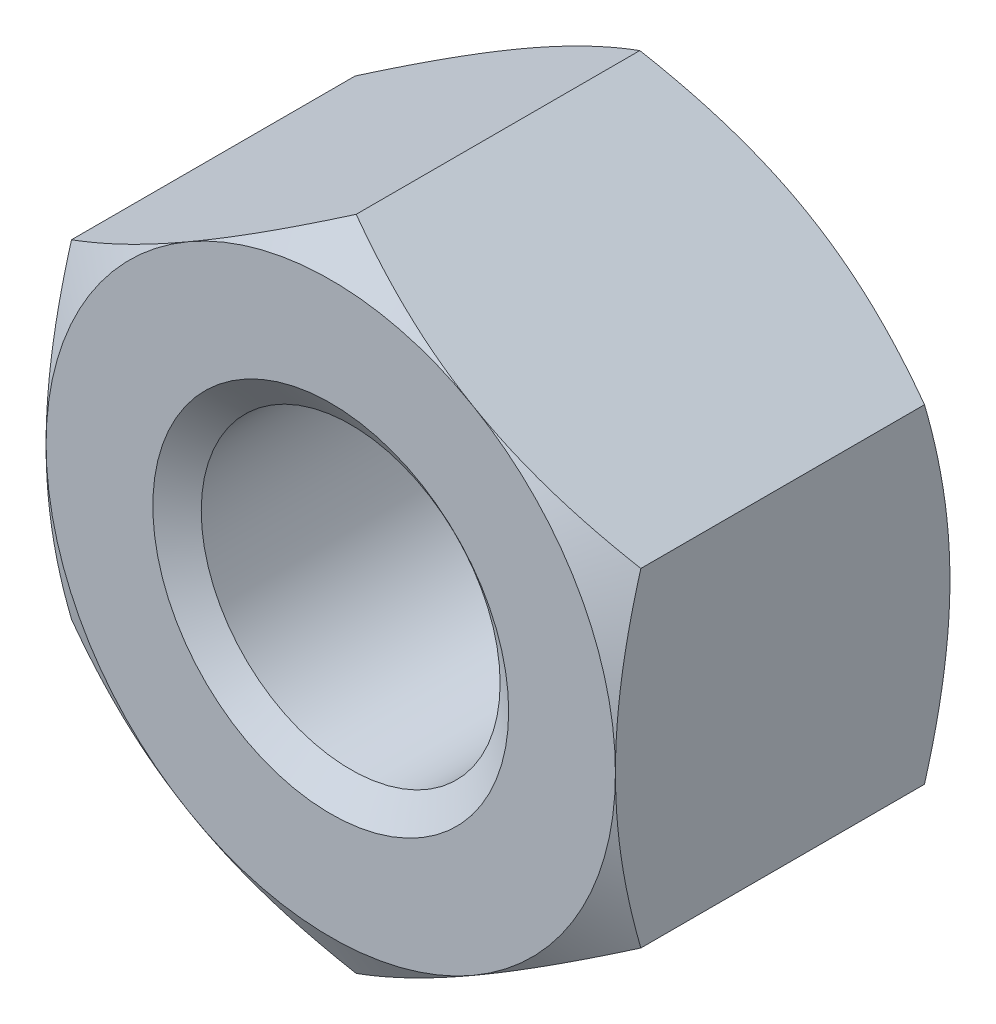
ISO-10303-21;
HEADER;
FILE_DESCRIPTION(('STEP AP214'),'2;1');
FILE_NAME('part.step','',(''),(''),'','','');
FILE_SCHEMA(('AUTOMOTIVE_DESIGN { 1 0 10303 214 1 1 1 1 }'));
ENDSEC;
DATA;
#1=APPLICATION_CONTEXT('core data for automotive mechanical design processes');
#2=APPLICATION_PROTOCOL_DEFINITION('international standard','automotive_design',2000,#1);
#3=PRODUCT_CONTEXT('',#1,'mechanical');
#4=PRODUCT('Part','Part','',(#3));
#5=PRODUCT_RELATED_PRODUCT_CATEGORY('part','',(#4));
#6=PRODUCT_DEFINITION_FORMATION('','',#4);
#7=PRODUCT_DEFINITION_CONTEXT('part definition',#1,'design');
#8=PRODUCT_DEFINITION('design','',#6,#7);
#9=PRODUCT_DEFINITION_SHAPE('','',#8);
#10=(LENGTH_UNIT() NAMED_UNIT(*) SI_UNIT(.MILLI.,.METRE.));
#11=(NAMED_UNIT(*) PLANE_ANGLE_UNIT() SI_UNIT($,.RADIAN.));
#12=(NAMED_UNIT(*) SI_UNIT($,.STERADIAN.) SOLID_ANGLE_UNIT());
#13=UNCERTAINTY_MEASURE_WITH_UNIT(LENGTH_MEASURE(1.E-05),#10,'distance_accuracy_value','');
#14=(GEOMETRIC_REPRESENTATION_CONTEXT(3) GLOBAL_UNCERTAINTY_ASSIGNED_CONTEXT((#13)) GLOBAL_UNIT_ASSIGNED_CONTEXT((#10,
#11,#12)) REPRESENTATION_CONTEXT('',''));
#15=CARTESIAN_POINT('',(0.,0.,0.));
#16=DIRECTION('',(0.,0.,1.));
#17=DIRECTION('',(1.,0.,0.));
#18=AXIS2_PLACEMENT_3D('',#15,#16,#17);
#19=CARTESIAN_POINT('',(0.,0.,-4.7));
#20=DIRECTION('',(0.,0.,1.));
#21=DIRECTION('',(1.,0.,0.));
#22=AXIS2_PLACEMENT_3D('',#19,#20,#21);
#23=CYLINDRICAL_SURFACE('',#22,2.1);
#24=CARTESIAN_POINT('',(0.,0.,-0.280083015283886));
#25=DIRECTION('',(0.,0.,1.));
#26=DIRECTION('',(1.,0.,0.));
#27=AXIS2_PLACEMENT_3D('',#24,#25,#26);
#28=CIRCLE('',#27,2.1);
#29=CARTESIAN_POINT('',(2.1,0.,-0.280083015283886));
#30=VERTEX_POINT('',#29);
#31=EDGE_CURVE('E176',#30,#30,#28,.F.);
#32=ORIENTED_EDGE('',*,*,#31,.F.);
#33=EDGE_LOOP('',(#32));
#34=FACE_BOUND('',#33,.T.);
#35=CARTESIAN_POINT('',(0.,0.,-4.39451698471612));
#36=DIRECTION('',(0.,0.,-1.));
#37=DIRECTION('',(-1.,0.,0.));
#38=AXIS2_PLACEMENT_3D('',#35,#36,#37);
#39=CIRCLE('',#38,2.1);
#40=CARTESIAN_POINT('',(-2.1,0.,-4.39451698471612));
#41=VERTEX_POINT('',#40);
#42=EDGE_CURVE('E40',#41,#41,#39,.F.);
#43=ORIENTED_EDGE('',*,*,#42,.F.);
#44=EDGE_LOOP('',(#43));
#45=FACE_BOUND('',#44,.T.);
#46=ADVANCED_FACE('F35',(#34,#45),#23,.F.);
#47=CARTESIAN_POINT('',(0.,4.61880215351701,-4.7));
#48=DIRECTION('',(-0.500000000000001,0.866025403784438,0.));
#49=DIRECTION('',(-0.866025403784438,-0.500000000000001,0.));
#50=AXIS2_PLACEMENT_3D('',#47,#48,#49);
#51=PLANE('',#50);
#52=DIRECTION('',(0.,0.,1.));
#53=VECTOR('',#52,1.);
#54=CARTESIAN_POINT('',(-4.,2.3094010767585,-4.7));
#55=LINE('',#54,#53);
#56=CARTESIAN_POINT('',(-4.,2.30940107675851,-4.34273441009183));
#57=VERTEX_POINT('',#56);
#58=CARTESIAN_POINT('',(-4.,2.3094010767585,-0.357265589908164));
#59=VERTEX_POINT('',#58);
#60=EDGE_CURVE('E166',#57,#59,#55,.T.);
#61=ORIENTED_EDGE('',*,*,#60,.T.);
#62=CARTESIAN_POINT('',(-4.0002,2.30928560670466,-0.357332259074768));
#63=CARTESIAN_POINT('',(-3.82442084967677,2.4107717464617,-0.298717873648283));
#64=CARTESIAN_POINT('',(-3.64712438367362,2.51313390883499,-0.245410321462263));
#65=CARTESIAN_POINT('',(-3.28946140682429,2.71963072479811,-0.152361670746403));
#66=CARTESIAN_POINT('',(-3.10908854102985,2.82376904741904,-0.112653489029704));
#67=CARTESIAN_POINT('',(-2.75057818129721,3.03075510011795,-0.0508422152802785));
#68=CARTESIAN_POINT('',(-2.57249584706486,3.13357098372492,-0.028327731522888));
#69=CARTESIAN_POINT('',(-2.21549328283349,3.33968651028528,-0.00145062314658079));
#70=CARTESIAN_POINT('',(-2.0365743503559,3.44298540411434,0.00293425857305778));
#71=CARTESIAN_POINT('',(-1.70225715780327,3.63600352522932,-0.00619007293996942));
#72=CARTESIAN_POINT('',(-1.54680884001293,3.72575165335065,-0.0174589539879935));
#73=CARTESIAN_POINT('',(-1.23692494436494,3.90466320392054,-0.0531739907981929));
#74=CARTESIAN_POINT('',(-1.08249043825587,3.99382600759478,-0.0776323457115331));
#75=CARTESIAN_POINT('',(-0.771967672225421,4.17310641015197,-0.13877606491929));
#76=CARTESIAN_POINT('',(-0.615918711936897,4.26320131938131,-0.175720603654865));
#77=CARTESIAN_POINT('',(-0.30614816459616,4.44204742827551,-0.259570072548029));
#78=CARTESIAN_POINT('',(-0.15242260922622,4.53080091904966,-0.306455302212742));
#79=CARTESIAN_POINT('',(0.000200000000000039,4.61891762357085,-0.35733225907477));
#80=B_SPLINE_CURVE_WITH_KNOTS('',3,(#62,#63,#64,#65,#66,#67,#68,#69,#70,#71,#72,#73,#74,#75,#76,
#77,#78,#79),.UNSPECIFIED.,.F.,.F.,(4,2,2,2,2,2,2,2,4),(0.,0.634047835695967,1.26961969224544,
1.88946157213122,2.50854226669297,3.04757825393386,3.58711366126904,4.13861653143764,
4.68903648037743),.UNSPECIFIED.);
#81=CARTESIAN_POINT('',(-2.,3.46410161513775,0.));
#82=VERTEX_POINT('',#81);
#83=EDGE_CURVE('E62',#59,#82,#80,.T.);
#84=ORIENTED_EDGE('',*,*,#83,.T.);
#85=CARTESIAN_POINT('',(0.,4.61880215351701,-0.357265589908166));
#86=VERTEX_POINT('',#85);
#87=EDGE_CURVE('E245',#82,#86,#80,.T.);
#88=ORIENTED_EDGE('',*,*,#87,.T.);
#89=DIRECTION('',(0.,0.,1.));
#90=VECTOR('',#89,1.);
#91=CARTESIAN_POINT('',(0.,4.61880215351701,-4.7));
#92=LINE('',#91,#90);
#93=CARTESIAN_POINT('',(0.,4.61880215351701,-4.34273441009183));
#94=VERTEX_POINT('',#93);
#95=EDGE_CURVE('E151',#94,#86,#92,.T.);
#96=ORIENTED_EDGE('',*,*,#95,.F.);
#97=CARTESIAN_POINT('',(-4.0002,2.30928560670466,-4.34266774092523));
#98=CARTESIAN_POINT('',(-3.82442084967677,2.4107717464617,-4.40128212635172));
#99=CARTESIAN_POINT('',(-3.64712438367362,2.51313390883499,-4.45458967853774));
#100=CARTESIAN_POINT('',(-3.28946140682429,2.71963072479811,-4.5476383292536));
#101=CARTESIAN_POINT('',(-3.10908854102985,2.82376904741904,-4.5873465109703));
#102=CARTESIAN_POINT('',(-2.75057818129721,3.03075510011795,-4.64915778471972));
#103=CARTESIAN_POINT('',(-2.57249584706486,3.13357098372492,-4.67167226847711));
#104=CARTESIAN_POINT('',(-2.21549328283349,3.33968651028528,-4.69854937685342));
#105=CARTESIAN_POINT('',(-2.0365743503559,3.44298540411434,-4.70293425857306));
#106=CARTESIAN_POINT('',(-1.70225715780327,3.63600352522932,-4.69380992706003));
#107=CARTESIAN_POINT('',(-1.54680884001293,3.72575165335065,-4.68254104601201));
#108=CARTESIAN_POINT('',(-1.23692494436494,3.90466320392054,-4.64682600920181));
#109=CARTESIAN_POINT('',(-1.08249043825587,3.99382600759479,-4.62236765428847));
#110=CARTESIAN_POINT('',(-0.771967672225421,4.17310641015197,-4.56122393508071));
#111=CARTESIAN_POINT('',(-0.615918711936897,4.26320131938131,-4.52427939634514));
#112=CARTESIAN_POINT('',(-0.30614816459616,4.44204742827551,-4.44042992745197));
#113=CARTESIAN_POINT('',(-0.152422609226221,4.53080091904966,-4.39354469778726));
#114=CARTESIAN_POINT('',(0.000200000000000049,4.61891762357085,-4.34266774092523));
#115=B_SPLINE_CURVE_WITH_KNOTS('',3,(#97,#98,#99,#100,#101,#102,#103,#104,#105,#106,#107,#108,
#109,#110,#111,#112,#113,#114),.UNSPECIFIED.,.F.,.F.,(4,2,2,2,2,2,2,2,4),(0.,0.634047835695967,
1.26961969224544,1.88946157213122,2.50854226669297,3.04757825393386,3.58711366126904,
4.13861653143764,4.68903648037743),.UNSPECIFIED.);
#116=CARTESIAN_POINT('',(-2.,3.46410161513775,-4.7));
#117=VERTEX_POINT('',#116);
#118=EDGE_CURVE('E169',#117,#94,#115,.T.);
#119=ORIENTED_EDGE('',*,*,#118,.F.);
#120=EDGE_CURVE('E268',#57,#117,#115,.T.);
#121=ORIENTED_EDGE('',*,*,#120,.F.);
#122=EDGE_LOOP('',(#61,#84,#88,#96,#119,#121));
#123=FACE_BOUND('',#122,.T.);
#124=ADVANCED_FACE('F37',(#123),#51,.T.);
#125=CARTESIAN_POINT('',(4.,2.3094010767585,-4.7));
#126=DIRECTION('',(0.500000000000001,0.866025403784438,0.));
#127=DIRECTION('',(-0.866025403784438,0.500000000000001,0.));
#128=AXIS2_PLACEMENT_3D('',#125,#126,#127);
#129=PLANE('',#128);
#130=ORIENTED_EDGE('',*,*,#95,.T.);
#131=CARTESIAN_POINT('',(-0.000199999999999629,4.61891762357085,-0.35733225907477));
#132=CARTESIAN_POINT('',(0.175579150323229,4.51743148381381,-0.298717873648285));
#133=CARTESIAN_POINT('',(0.352875616326382,4.41506932144052,-0.245410321462265));
#134=CARTESIAN_POINT('',(0.710538593175707,4.2085725054774,-0.152361670746404));
#135=CARTESIAN_POINT('',(0.890911458970152,4.10443418285647,-0.112653489029704));
#136=CARTESIAN_POINT('',(1.24942181870279,3.89744813015756,-0.0508422152802785));
#137=CARTESIAN_POINT('',(1.42750415293514,3.79463224655059,-0.0283277315228882));
#138=CARTESIAN_POINT('',(1.78450671716651,3.58851671999023,-0.00145062314658112));
#139=CARTESIAN_POINT('',(1.9634256496441,3.48521782616117,0.00293425857305746));
#140=CARTESIAN_POINT('',(2.29774284219673,3.29219970504619,-0.00619007293996938));
#141=CARTESIAN_POINT('',(2.45319115998707,3.20245157692486,-0.0174589539879932));
#142=CARTESIAN_POINT('',(2.76307505563506,3.02354002635496,-0.0531739907981921));
#143=CARTESIAN_POINT('',(2.91750956174413,2.93437722268072,-0.0776323457115322));
#144=CARTESIAN_POINT('',(3.22803232777458,2.75509682012354,-0.138776064919289));
#145=CARTESIAN_POINT('',(3.3840812880631,2.6650019108942,-0.175720603654864));
#146=CARTESIAN_POINT('',(3.69385183540384,2.486155802,-0.259570072548028));
#147=CARTESIAN_POINT('',(3.84757739077378,2.39740231122584,-0.306455302212741));
#148=CARTESIAN_POINT('',(4.0002,2.30928560670466,-0.357332259074768));
#149=B_SPLINE_CURVE_WITH_KNOTS('',3,(#131,#132,#133,#134,#135,#136,#137,#138,#139,#140,#141,
#142,#143,#144,#145,#146,#147,#148),.UNSPECIFIED.,.F.,.F.,(4,2,2,2,2,2,2,2,4),(0.,
0.634047835695967,1.26961969224544,1.88946157213122,2.50854226669297,3.04757825393386,
3.58711366126904,4.13861653143764,4.68903648037743),.UNSPECIFIED.);
#150=CARTESIAN_POINT('',(2.,3.46410161513775,0.));
#151=VERTEX_POINT('',#150);
#152=EDGE_CURVE('E144',#86,#151,#149,.T.);
#153=ORIENTED_EDGE('',*,*,#152,.T.);
#154=CARTESIAN_POINT('',(4.,2.30940107675851,-0.357265589908166));
#155=VERTEX_POINT('',#154);
#156=EDGE_CURVE('E130',#151,#155,#149,.T.);
#157=ORIENTED_EDGE('',*,*,#156,.T.);
#158=DIRECTION('',(0.,0.,1.));
#159=VECTOR('',#158,1.);
#160=CARTESIAN_POINT('',(4.,2.3094010767585,-4.7));
#161=LINE('',#160,#159);
#162=CARTESIAN_POINT('',(4.,2.30940107675851,-4.34273441009183));
#163=VERTEX_POINT('',#162);
#164=EDGE_CURVE('E143',#163,#155,#161,.T.);
#165=ORIENTED_EDGE('',*,*,#164,.F.);
#166=CARTESIAN_POINT('',(-0.000199999999999838,4.61891762357085,-4.34266774092523));
#167=CARTESIAN_POINT('',(0.175579150323229,4.51743148381381,-4.40128212635172));
#168=CARTESIAN_POINT('',(0.352875616326382,4.41506932144052,-4.45458967853773));
#169=CARTESIAN_POINT('',(0.710538593175708,4.20857250547739,-4.5476383292536));
#170=CARTESIAN_POINT('',(0.890911458970152,4.10443418285647,-4.5873465109703));
#171=CARTESIAN_POINT('',(1.24942181870279,3.89744813015756,-4.64915778471972));
#172=CARTESIAN_POINT('',(1.42750415293514,3.79463224655059,-4.67167226847711));
#173=CARTESIAN_POINT('',(1.78450671716651,3.58851671999023,-4.69854937685342));
#174=CARTESIAN_POINT('',(1.9634256496441,3.48521782616117,-4.70293425857306));
#175=CARTESIAN_POINT('',(2.29774284219673,3.29219970504619,-4.69380992706003));
#176=CARTESIAN_POINT('',(2.45319115998707,3.20245157692486,-4.68254104601201));
#177=CARTESIAN_POINT('',(2.76307505563506,3.02354002635496,-4.64682600920181));
#178=CARTESIAN_POINT('',(2.91750956174413,2.93437722268072,-4.62236765428847));
#179=CARTESIAN_POINT('',(3.22803232777458,2.75509682012354,-4.56122393508071));
#180=CARTESIAN_POINT('',(3.3840812880631,2.6650019108942,-4.52427939634514));
#181=CARTESIAN_POINT('',(3.69385183540384,2.486155802,-4.44042992745197));
#182=CARTESIAN_POINT('',(3.84757739077378,2.39740231122584,-4.39354469778726));
#183=CARTESIAN_POINT('',(4.0002,2.30928560670466,-4.34266774092523));
#184=B_SPLINE_CURVE_WITH_KNOTS('',3,(#166,#167,#168,#169,#170,#171,#172,#173,#174,#175,#176,
#177,#178,#179,#180,#181,#182,#183),.UNSPECIFIED.,.F.,.F.,(4,2,2,2,2,2,2,2,4),(0.,
0.634047835695967,1.26961969224544,1.88946157213122,2.50854226669297,3.04757825393386,
3.58711366126904,4.13861653143764,4.68903648037743),.UNSPECIFIED.);
#185=CARTESIAN_POINT('',(2.,3.46410161513775,-4.7));
#186=VERTEX_POINT('',#185);
#187=EDGE_CURVE('E261',#186,#163,#184,.T.);
#188=ORIENTED_EDGE('',*,*,#187,.F.);
#189=EDGE_CURVE('E267',#94,#186,#184,.T.);
#190=ORIENTED_EDGE('',*,*,#189,.F.);
#191=EDGE_LOOP('',(#130,#153,#157,#165,#188,#190));
#192=FACE_BOUND('',#191,.T.);
#193=ADVANCED_FACE('F141',(#192),#129,.T.);
#194=CARTESIAN_POINT('',(4.,2.3094010767585,-4.7));
#195=DIRECTION('',(-1.,0.,0.));
#196=DIRECTION('',(0.,0.,1.));
#197=AXIS2_PLACEMENT_3D('',#194,#195,#196);
#198=PLANE('',#197);
#199=CARTESIAN_POINT('',(4.,-6.12487198995892,-1.91410682124064));
#200=CARTESIAN_POINT('',(4.,-5.94924937038676,-1.8292362707669));
#201=CARTESIAN_POINT('',(4.,-5.77321152095286,-1.7452094038074));
#202=CARTESIAN_POINT('',(4.,-5.42008084777954,-1.57932514679717));
#203=CARTESIAN_POINT('',(4.,-5.24298784779927,-1.49746813236723));
#204=CARTESIAN_POINT('',(4.,-4.88656571686334,-1.33597446305856));
#205=CARTESIAN_POINT('',(4.,-4.70722958889362,-1.25635319506304));
#206=CARTESIAN_POINT('',(4.,-4.34708334747263,-1.1005305854203));
#207=CARTESIAN_POINT('',(4.,-4.16627331143537,-1.02432906550802));
#208=CARTESIAN_POINT('',(4.,-3.80064706744977,-0.875350650394363));
#209=CARTESIAN_POINT('',(4.,-3.6158089282277,-0.802627284215846));
#210=CARTESIAN_POINT('',(4.,-3.24395246794968,-0.66287623095942));
#211=CARTESIAN_POINT('',(4.,-3.05693390695801,-0.595849177566505));
#212=CARTESIAN_POINT('',(4.,-2.6808031825377,-0.469291748430882));
#213=CARTESIAN_POINT('',(4.,-2.49169643712848,-0.409745434783838));
#214=CARTESIAN_POINT('',(4.,-2.11079454635851,-0.300083356544506));
#215=CARTESIAN_POINT('',(4.,-1.91900027185749,-0.249964609676752));
#216=CARTESIAN_POINT('',(4.,-1.532592326982,-0.161590794954041));
#217=CARTESIAN_POINT('',(4.,-1.3379779203165,-0.12333888595654));
#218=CARTESIAN_POINT('',(4.,-0.946402725872553,-0.0612742359223427));
#219=CARTESIAN_POINT('',(4.,-0.749441936019773,-0.0374615076516983));
#220=CARTESIAN_POINT('',(4.,-0.355451989627942,-0.00638181314943576));
#221=CARTESIAN_POINT('',(4.,-0.15843131109401,0.000989900761041864));
#222=CARTESIAN_POINT('',(4.,0.23547208560747,-0.00120406637479539));
#223=CARTESIAN_POINT('',(4.,0.432354826312206,-0.0107653508153508));
#224=CARTESIAN_POINT('',(4.,0.768560635225518,-0.040878734613591));
#225=CARTESIAN_POINT('',(4.,0.90825461838182,-0.05750929604391));
#226=CARTESIAN_POINT('',(4.,1.18656349063497,-0.098213410346692));
#227=CARTESIAN_POINT('',(4.,1.32517820601013,-0.122288137058446));
#228=CARTESIAN_POINT('',(4.,1.73929045452969,-0.204415070950231));
#229=CARTESIAN_POINT('',(4.,2.01284690528722,-0.272348886425154));
#230=CARTESIAN_POINT('',(4.,2.42218253014524,-0.389516359317205));
#231=CARTESIAN_POINT('',(4.,2.56009536361539,-0.431713941811638));
#232=CARTESIAN_POINT('',(4.,2.83448159101404,-0.520284580227764));
#233=CARTESIAN_POINT('',(4.,2.97095590623557,-0.566654756186914));
#234=CARTESIAN_POINT('',(4.,3.24189440516341,-0.662605699180288));
#235=CARTESIAN_POINT('',(4.,3.37636557946838,-0.712166925753502));
#236=CARTESIAN_POINT('',(4.,3.64426461152914,-0.814198353790704));
#237=CARTESIAN_POINT('',(4.,3.77769202239387,-0.866669730963371));
#238=CARTESIAN_POINT('',(4.,3.91063698986684,-0.920309006541794));
#239=B_SPLINE_CURVE_WITH_KNOTS('',3,(#199,#200,#201,#202,#203,#204,#205,#206,#207,#208,#209,
#210,#211,#212,#213,#214,#215,#216,#217,#218,#219,#220,#221,#222,#223,#224,#225,#226,#227,#228,
#229,#230,#231,#232,#233,#234,#235,#236,#237,#238),.UNSPECIFIED.,.F.,.F.,(4,2,2,2,2,2,2,2,2,2,2,
2,2,2,2,2,2,2,2,4),(0.,0.585171792532271,1.17044423059927,1.7590659464599,2.34765694284827,
2.94347400997483,3.53935727210689,4.13394864697601,4.72835161391471,5.32291267067845,
5.91747425310813,6.50823685854037,7.09884609659886,7.52068140825521,7.9425832713084,
8.7870149135983,9.21965281897689,9.65199437116297,10.0819024146297,10.5119854255247),.UNSPECIFIED.);
#240=CARTESIAN_POINT('',(4.,-2.30940107675851,-0.357265589908166));
#241=VERTEX_POINT('',#240);
#242=CARTESIAN_POINT('',(4.,0.,0.));
#243=VERTEX_POINT('',#242);
#244=EDGE_CURVE('E136',#241,#243,#239,.T.);
#245=ORIENTED_EDGE('',*,*,#244,.F.);
#246=DIRECTION('',(0.,0.,1.));
#247=VECTOR('',#246,1.);
#248=CARTESIAN_POINT('',(4.,-2.30940107675851,-4.7));
#249=LINE('',#248,#247);
#250=CARTESIAN_POINT('',(4.,-2.30940107675851,-4.34273441009183));
#251=VERTEX_POINT('',#250);
#252=EDGE_CURVE('E152',#251,#241,#249,.T.);
#253=ORIENTED_EDGE('',*,*,#252,.F.);
#254=CARTESIAN_POINT('',(4.,-6.12487198995892,-2.78589317875936));
#255=CARTESIAN_POINT('',(4.,-5.94924937038676,-2.8707637292331));
#256=CARTESIAN_POINT('',(4.,-5.77321152095286,-2.9547905961926));
#257=CARTESIAN_POINT('',(4.,-5.42008084777954,-3.12067485320283));
#258=CARTESIAN_POINT('',(4.,-5.24298784779928,-3.20253186763277));
#259=CARTESIAN_POINT('',(4.,-4.88656571686334,-3.36402553694144));
#260=CARTESIAN_POINT('',(4.,-4.70722958889362,-3.44364680493696));
#261=CARTESIAN_POINT('',(4.,-4.34708334747263,-3.5994694145797));
#262=CARTESIAN_POINT('',(4.,-4.16627331143537,-3.67567093449198));
#263=CARTESIAN_POINT('',(4.,-3.80064706744978,-3.82464934960564));
#264=CARTESIAN_POINT('',(4.,-3.6158089282277,-3.89737271578415));
#265=CARTESIAN_POINT('',(4.,-3.24395246794968,-4.03712376904058));
#266=CARTESIAN_POINT('',(4.,-3.05693390695801,-4.1041508224335));
#267=CARTESIAN_POINT('',(4.,-2.68080318253771,-4.23070825156912));
#268=CARTESIAN_POINT('',(4.,-2.49169643712849,-4.29025456521616));
#269=CARTESIAN_POINT('',(4.,-2.11079454635851,-4.39991664345549));
#270=CARTESIAN_POINT('',(4.,-1.91900027185749,-4.45003539032325));
#271=CARTESIAN_POINT('',(4.,-1.532592326982,-4.53840920504596));
#272=CARTESIAN_POINT('',(4.,-1.3379779203165,-4.57666111404346));
#273=CARTESIAN_POINT('',(4.,-0.946402725872553,-4.63872576407766));
#274=CARTESIAN_POINT('',(4.,-0.749441936019773,-4.6625384923483));
#275=CARTESIAN_POINT('',(4.,-0.355451989627942,-4.69361818685056));
#276=CARTESIAN_POINT('',(4.,-0.158431311094011,-4.70098990076104));
#277=CARTESIAN_POINT('',(4.,0.235472085607469,-4.69879593362521));
#278=CARTESIAN_POINT('',(4.,0.432354826312206,-4.68923464918465));
#279=CARTESIAN_POINT('',(4.,0.768560635225517,-4.65912126538641));
#280=CARTESIAN_POINT('',(4.,0.90825461838182,-4.64249070395609));
#281=CARTESIAN_POINT('',(4.,1.18656349063497,-4.60178658965331));
#282=CARTESIAN_POINT('',(4.,1.32517820601013,-4.57771186294155));
#283=CARTESIAN_POINT('',(4.,1.73929045452969,-4.49558492904977));
#284=CARTESIAN_POINT('',(4.,2.01284690528722,-4.42765111357485));
#285=CARTESIAN_POINT('',(4.,2.42218253014524,-4.3104836406828));
#286=CARTESIAN_POINT('',(4.,2.56009536361538,-4.26828605818836));
#287=CARTESIAN_POINT('',(4.,2.83448159101404,-4.17971541977224));
#288=CARTESIAN_POINT('',(4.,2.97095590623557,-4.13334524381309));
#289=CARTESIAN_POINT('',(4.,3.24189440516341,-4.03739430081971));
#290=CARTESIAN_POINT('',(4.,3.37636557946838,-3.9878330742465));
#291=CARTESIAN_POINT('',(4.,3.64426461152914,-3.8858016462093));
#292=CARTESIAN_POINT('',(4.,3.77769202239387,-3.83333026903663));
#293=CARTESIAN_POINT('',(4.,3.91063698986684,-3.77969099345821));
#294=B_SPLINE_CURVE_WITH_KNOTS('',3,(#254,#255,#256,#257,#258,#259,#260,#261,#262,#263,#264,
#265,#266,#267,#268,#269,#270,#271,#272,#273,#274,#275,#276,#277,#278,#279,#280,#281,#282,#283,
#284,#285,#286,#287,#288,#289,#290,#291,#292,#293),.UNSPECIFIED.,.F.,.F.,(4,2,2,2,2,2,2,2,2,2,2,
2,2,2,2,2,2,2,2,4),(0.,0.585171792532271,1.17044423059927,1.7590659464599,2.34765694284827,
2.94347400997483,3.53935727210689,4.133948646976,4.72835161391471,5.32291267067845,
5.91747425310813,6.50823685854037,7.09884609659886,7.52068140825521,7.9425832713084,
8.78701491359829,9.21965281897689,9.65199437116297,10.0819024146297,10.5119854255247),.UNSPECIFIED.);
#295=CARTESIAN_POINT('',(4.,0.,-4.7));
#296=VERTEX_POINT('',#295);
#297=EDGE_CURVE('E274',#251,#296,#294,.T.);
#298=ORIENTED_EDGE('',*,*,#297,.T.);
#299=EDGE_CURVE('E150',#296,#163,#294,.T.);
#300=ORIENTED_EDGE('',*,*,#299,.T.);
#301=ORIENTED_EDGE('',*,*,#164,.T.);
#302=EDGE_CURVE('E127',#243,#155,#239,.T.);
#303=ORIENTED_EDGE('',*,*,#302,.F.);
#304=EDGE_LOOP('',(#245,#253,#298,#300,#301,#303));
#305=FACE_BOUND('',#304,.T.);
#306=ADVANCED_FACE('F147',(#305),#198,.F.);
#307=CARTESIAN_POINT('',(0.,-4.61880215351701,-4.7));
#308=DIRECTION('',(0.500000000000001,-0.866025403784438,0.));
#309=DIRECTION('',(0.866025403784438,0.500000000000001,0.));
#310=AXIS2_PLACEMENT_3D('',#307,#308,#309);
#311=PLANE('',#310);
#312=ORIENTED_EDGE('',*,*,#252,.T.);
#313=CARTESIAN_POINT('',(4.0002,-2.30928560670467,-0.35733225907477));
#314=CARTESIAN_POINT('',(3.82442084967677,-2.41077174646171,-0.298717873648285));
#315=CARTESIAN_POINT('',(3.64712438367362,-2.513133908835,-0.245410321462265));
#316=CARTESIAN_POINT('',(3.28946140682429,-2.71963072479812,-0.152361670746405));
#317=CARTESIAN_POINT('',(3.10908854102985,-2.82376904741905,-0.112653489029705));
#318=CARTESIAN_POINT('',(2.75057818129721,-3.03075510011796,-0.0508422152802802));
#319=CARTESIAN_POINT('',(2.57249584706486,-3.13357098372492,-0.0283277315228902));
#320=CARTESIAN_POINT('',(2.21549328283349,-3.33968651028529,-0.00145062314658334));
#321=CARTESIAN_POINT('',(2.0365743503559,-3.44298540411435,0.00293425857305541));
#322=CARTESIAN_POINT('',(1.70225715780327,-3.63600352522933,-0.00619007293997226));
#323=CARTESIAN_POINT('',(1.54680884001293,-3.72575165335065,-0.0174589539879969));
#324=CARTESIAN_POINT('',(1.23692494436494,-3.90466320392055,-0.0531739907981965));
#325=CARTESIAN_POINT('',(1.08249043825587,-3.99382600759479,-0.0776323457115365));
#326=CARTESIAN_POINT('',(0.77196767222542,-4.17310641015198,-0.138776064919293));
#327=CARTESIAN_POINT('',(0.615918711936896,-4.26320131938132,-0.175720603654868));
#328=CARTESIAN_POINT('',(0.30614816459616,-4.44204742827551,-0.259570072548032));
#329=CARTESIAN_POINT('',(0.152422609226221,-4.53080091904967,-0.306455302212746));
#330=CARTESIAN_POINT('',(-0.000199999999999862,-4.61891762357085,-0.357332259074773));
#331=B_SPLINE_CURVE_WITH_KNOTS('',3,(#313,#314,#315,#316,#317,#318,#319,#320,#321,#322,#323,
#324,#325,#326,#327,#328,#329,#330),.UNSPECIFIED.,.F.,.F.,(4,2,2,2,2,2,2,2,4),(0.,
0.634047835695967,1.26961969224544,1.88946157213122,2.50854226669297,3.04757825393386,
3.58711366126904,4.13861653143764,4.68903648037743),.UNSPECIFIED.);
#332=CARTESIAN_POINT('',(2.,-3.46410161513775,0.));
#333=VERTEX_POINT('',#332);
#334=EDGE_CURVE('E549',#241,#333,#331,.T.);
#335=ORIENTED_EDGE('',*,*,#334,.T.);
#336=CARTESIAN_POINT('',(0.,-4.61880215351701,-0.357265589908166));
#337=VERTEX_POINT('',#336);
#338=EDGE_CURVE('E229',#333,#337,#331,.T.);
#339=ORIENTED_EDGE('',*,*,#338,.T.);
#340=DIRECTION('',(0.,0.,1.));
#341=VECTOR('',#340,1.);
#342=CARTESIAN_POINT('',(0.,-4.61880215351701,-4.7));
#343=LINE('',#342,#341);
#344=CARTESIAN_POINT('',(0.,-4.61880215351701,-4.34273441009183));
#345=VERTEX_POINT('',#344);
#346=EDGE_CURVE('E157',#345,#337,#343,.T.);
#347=ORIENTED_EDGE('',*,*,#346,.F.);
#348=CARTESIAN_POINT('',(4.0002,-2.30928560670467,-4.34266774092523));
#349=CARTESIAN_POINT('',(3.82442084967677,-2.41077174646171,-4.40128212635172));
#350=CARTESIAN_POINT('',(3.64712438367362,-2.513133908835,-4.45458967853774));
#351=CARTESIAN_POINT('',(3.28946140682429,-2.71963072479812,-4.5476383292536));
#352=CARTESIAN_POINT('',(3.10908854102985,-2.82376904741905,-4.58734651097029));
#353=CARTESIAN_POINT('',(2.75057818129721,-3.03075510011796,-4.64915778471972));
#354=CARTESIAN_POINT('',(2.57249584706486,-3.13357098372492,-4.67167226847711));
#355=CARTESIAN_POINT('',(2.21549328283349,-3.33968651028529,-4.69854937685342));
#356=CARTESIAN_POINT('',(2.0365743503559,-3.44298540411435,-4.70293425857306));
#357=CARTESIAN_POINT('',(1.70225715780327,-3.63600352522933,-4.69380992706003));
#358=CARTESIAN_POINT('',(1.54680884001293,-3.72575165335065,-4.682541046012));
#359=CARTESIAN_POINT('',(1.23692494436494,-3.90466320392055,-4.6468260092018));
#360=CARTESIAN_POINT('',(1.08249043825587,-3.99382600759479,-4.62236765428846));
#361=CARTESIAN_POINT('',(0.771967672225421,-4.17310641015198,-4.56122393508071));
#362=CARTESIAN_POINT('',(0.615918711936897,-4.26320131938132,-4.52427939634513));
#363=CARTESIAN_POINT('',(0.30614816459616,-4.44204742827551,-4.44042992745197));
#364=CARTESIAN_POINT('',(0.15242260922622,-4.53080091904967,-4.39354469778725));
#365=CARTESIAN_POINT('',(-0.000200000000000249,-4.61891762357085,-4.34266774092523));
#366=B_SPLINE_CURVE_WITH_KNOTS('',3,(#348,#349,#350,#351,#352,#353,#354,#355,#356,#357,#358,
#359,#360,#361,#362,#363,#364,#365),.UNSPECIFIED.,.F.,.F.,(4,2,2,2,2,2,2,2,4),(0.,
0.634047835695967,1.26961969224544,1.88946157213122,2.50854226669297,3.04757825393386,
3.58711366126904,4.13861653143764,4.68903648037743),.UNSPECIFIED.);
#367=CARTESIAN_POINT('',(2.,-3.46410161513775,-4.7));
#368=VERTEX_POINT('',#367);
#369=EDGE_CURVE('E281',#368,#345,#366,.T.);
#370=ORIENTED_EDGE('',*,*,#369,.F.);
#371=EDGE_CURVE('E280',#251,#368,#366,.T.);
#372=ORIENTED_EDGE('',*,*,#371,.F.);
#373=EDGE_LOOP('',(#312,#335,#339,#347,#370,#372));
#374=FACE_BOUND('',#373,.T.);
#375=ADVANCED_FACE('F293',(#374),#311,.T.);
#376=CARTESIAN_POINT('',(-4.,-2.30940107675851,-4.7));
#377=DIRECTION('',(-0.500000000000001,-0.866025403784438,0.));
#378=DIRECTION('',(0.866025403784438,-0.500000000000001,0.));
#379=AXIS2_PLACEMENT_3D('',#376,#377,#378);
#380=PLANE('',#379);
#381=ORIENTED_EDGE('',*,*,#346,.T.);
#382=CARTESIAN_POINT('',(0.0002,-4.61891762357085,-0.357332259074773));
#383=CARTESIAN_POINT('',(-0.175579150323229,-4.51743148381381,-0.298717873648288));
#384=CARTESIAN_POINT('',(-0.352875616326382,-4.41506932144052,-0.245410321462267));
#385=CARTESIAN_POINT('',(-0.710538593175708,-4.2085725054774,-0.152361670746407));
#386=CARTESIAN_POINT('',(-0.890911458970153,-4.10443418285647,-0.112653489029707));
#387=CARTESIAN_POINT('',(-1.24942181870279,-3.89744813015756,-0.0508422152802814));
#388=CARTESIAN_POINT('',(-1.42750415293515,-3.7946322465506,-0.028327731522891));
#389=CARTESIAN_POINT('',(-1.78450671716651,-3.58851671999023,-0.00145062314658339));
#390=CARTESIAN_POINT('',(-1.9634256496441,-3.48521782616117,0.00293425857305552));
#391=CARTESIAN_POINT('',(-2.29774284219674,-3.29219970504619,-0.00619007293997165));
#392=CARTESIAN_POINT('',(-2.45319115998707,-3.20245157692487,-0.0174589539879959));
#393=CARTESIAN_POINT('',(-2.76307505563506,-3.02354002635497,-0.0531739907981952));
#394=CARTESIAN_POINT('',(-2.91750956174413,-2.93437722268073,-0.077632345711535));
#395=CARTESIAN_POINT('',(-3.22803232777458,-2.75509682012354,-0.138776064919291));
#396=CARTESIAN_POINT('',(-3.3840812880631,-2.6650019108942,-0.175720603654865));
#397=CARTESIAN_POINT('',(-3.69385183540384,-2.48615580200001,-0.259570072548029));
#398=CARTESIAN_POINT('',(-3.84757739077378,-2.39740231122585,-0.306455302212742));
#399=CARTESIAN_POINT('',(-4.0002,-2.30928560670467,-0.357332259074769));
#400=B_SPLINE_CURVE_WITH_KNOTS('',3,(#382,#383,#384,#385,#386,#387,#388,#389,#390,#391,#392,
#393,#394,#395,#396,#397,#398,#399),.UNSPECIFIED.,.F.,.F.,(4,2,2,2,2,2,2,2,4),(0.,
0.634047835695968,1.26961969224544,1.88946157213123,2.50854226669298,3.04757825393386,
3.58711366126904,4.13861653143764,4.68903648037743),.UNSPECIFIED.);
#401=CARTESIAN_POINT('',(-2.,-3.46410161513775,0.));
#402=VERTEX_POINT('',#401);
#403=EDGE_CURVE('E547',#337,#402,#400,.T.);
#404=ORIENTED_EDGE('',*,*,#403,.T.);
#405=CARTESIAN_POINT('',(-4.,-2.30940107675851,-0.357265589908166));
#406=VERTEX_POINT('',#405);
#407=EDGE_CURVE('E201',#402,#406,#400,.T.);
#408=ORIENTED_EDGE('',*,*,#407,.T.);
#409=DIRECTION('',(0.,0.,1.));
#410=VECTOR('',#409,1.);
#411=CARTESIAN_POINT('',(-4.,-2.30940107675851,-4.7));
#412=LINE('',#411,#410);
#413=CARTESIAN_POINT('',(-4.,-2.30940107675851,-4.34273441009183));
#414=VERTEX_POINT('',#413);
#415=EDGE_CURVE('E163',#414,#406,#412,.T.);
#416=ORIENTED_EDGE('',*,*,#415,.F.);
#417=CARTESIAN_POINT('',(0.0002,-4.61891762357085,-4.34266774092523));
#418=CARTESIAN_POINT('',(-0.175579150323229,-4.51743148381381,-4.40128212635171));
#419=CARTESIAN_POINT('',(-0.352875616326382,-4.41506932144052,-4.45458967853773));
#420=CARTESIAN_POINT('',(-0.710538593175708,-4.2085725054774,-4.54763832925359));
#421=CARTESIAN_POINT('',(-0.890911458970153,-4.10443418285647,-4.58734651097029));
#422=CARTESIAN_POINT('',(-1.24942181870279,-3.89744813015756,-4.64915778471972));
#423=CARTESIAN_POINT('',(-1.42750415293515,-3.7946322465506,-4.67167226847711));
#424=CARTESIAN_POINT('',(-1.78450671716651,-3.58851671999023,-4.69854937685342));
#425=CARTESIAN_POINT('',(-1.9634256496441,-3.48521782616117,-4.70293425857306));
#426=CARTESIAN_POINT('',(-2.29774284219674,-3.29219970504619,-4.69380992706003));
#427=CARTESIAN_POINT('',(-2.45319115998707,-3.20245157692487,-4.682541046012));
#428=CARTESIAN_POINT('',(-2.76307505563506,-3.02354002635497,-4.6468260092018));
#429=CARTESIAN_POINT('',(-2.91750956174413,-2.93437722268073,-4.62236765428846));
#430=CARTESIAN_POINT('',(-3.22803232777458,-2.75509682012354,-4.56122393508071));
#431=CARTESIAN_POINT('',(-3.3840812880631,-2.6650019108942,-4.52427939634513));
#432=CARTESIAN_POINT('',(-3.69385183540384,-2.48615580200001,-4.44042992745197));
#433=CARTESIAN_POINT('',(-3.84757739077378,-2.39740231122585,-4.39354469778726));
#434=CARTESIAN_POINT('',(-4.0002,-2.30928560670467,-4.34266774092523));
#435=B_SPLINE_CURVE_WITH_KNOTS('',3,(#417,#418,#419,#420,#421,#422,#423,#424,#425,#426,#427,
#428,#429,#430,#431,#432,#433,#434),.UNSPECIFIED.,.F.,.F.,(4,2,2,2,2,2,2,2,4),(0.,
0.634047835695967,1.26961969224544,1.88946157213123,2.50854226669298,3.04757825393386,
3.58711366126904,4.13861653143764,4.68903648037743),.UNSPECIFIED.);
#436=CARTESIAN_POINT('',(-2.,-3.46410161513775,-4.7));
#437=VERTEX_POINT('',#436);
#438=EDGE_CURVE('E288',#437,#414,#435,.T.);
#439=ORIENTED_EDGE('',*,*,#438,.F.);
#440=EDGE_CURVE('E287',#345,#437,#435,.T.);
#441=ORIENTED_EDGE('',*,*,#440,.F.);
#442=EDGE_LOOP('',(#381,#404,#408,#416,#439,#441));
#443=FACE_BOUND('',#442,.T.);
#444=ADVANCED_FACE('F296',(#443),#380,.T.);
#445=CARTESIAN_POINT('',(-4.,2.3094010767585,-4.7));
#446=DIRECTION('',(-1.,0.,0.));
#447=DIRECTION('',(0.,0.,1.));
#448=AXIS2_PLACEMENT_3D('',#445,#446,#447);
#449=PLANE('',#448);
#450=ORIENTED_EDGE('',*,*,#415,.T.);
#451=CARTESIAN_POINT('',(-4.,-6.12487198995892,-1.91410682124064));
#452=CARTESIAN_POINT('',(-4.,-5.94924937038676,-1.8292362707669));
#453=CARTESIAN_POINT('',(-4.,-5.77321152095286,-1.7452094038074));
#454=CARTESIAN_POINT('',(-4.,-5.42008084777954,-1.57932514679717));
#455=CARTESIAN_POINT('',(-4.,-5.24298784779927,-1.49746813236723));
#456=CARTESIAN_POINT('',(-4.,-4.88656571686334,-1.33597446305856));
#457=CARTESIAN_POINT('',(-4.,-4.70722958889362,-1.25635319506304));
#458=CARTESIAN_POINT('',(-4.,-4.34708334747263,-1.1005305854203));
#459=CARTESIAN_POINT('',(-4.,-4.16627331143537,-1.02432906550802));
#460=CARTESIAN_POINT('',(-4.,-3.80064706744977,-0.875350650394363));
#461=CARTESIAN_POINT('',(-4.,-3.6158089282277,-0.802627284215846));
#462=CARTESIAN_POINT('',(-4.,-3.24395246794968,-0.66287623095942));
#463=CARTESIAN_POINT('',(-4.,-3.05693390695801,-0.595849177566505));
#464=CARTESIAN_POINT('',(-4.,-2.6808031825377,-0.469291748430882));
#465=CARTESIAN_POINT('',(-4.,-2.49169643712848,-0.409745434783838));
#466=CARTESIAN_POINT('',(-4.,-2.11079454635851,-0.300083356544506));
#467=CARTESIAN_POINT('',(-4.,-1.91900027185749,-0.249964609676752));
#468=CARTESIAN_POINT('',(-4.,-1.532592326982,-0.161590794954041));
#469=CARTESIAN_POINT('',(-4.,-1.3379779203165,-0.12333888595654));
#470=CARTESIAN_POINT('',(-4.,-0.946402725872553,-0.0612742359223427));
#471=CARTESIAN_POINT('',(-4.,-0.749441936019773,-0.0374615076516983));
#472=CARTESIAN_POINT('',(-4.,-0.355451989627942,-0.00638181314943576));
#473=CARTESIAN_POINT('',(-4.,-0.15843131109401,0.000989900761041864));
#474=CARTESIAN_POINT('',(-4.,0.23547208560747,-0.00120406637479539));
#475=CARTESIAN_POINT('',(-4.,0.432354826312206,-0.0107653508153508));
#476=CARTESIAN_POINT('',(-4.,0.768560635225518,-0.040878734613591));
#477=CARTESIAN_POINT('',(-4.,0.90825461838182,-0.05750929604391));
#478=CARTESIAN_POINT('',(-4.,1.18656349063497,-0.098213410346692));
#479=CARTESIAN_POINT('',(-4.,1.32517820601013,-0.122288137058446));
#480=CARTESIAN_POINT('',(-4.,1.73929045452969,-0.204415070950231));
#481=CARTESIAN_POINT('',(-4.,2.01284690528722,-0.272348886425154));
#482=CARTESIAN_POINT('',(-4.,2.42218253014524,-0.389516359317205));
#483=CARTESIAN_POINT('',(-4.,2.56009536361539,-0.431713941811638));
#484=CARTESIAN_POINT('',(-4.,2.83448159101404,-0.520284580227764));
#485=CARTESIAN_POINT('',(-4.,2.97095590623557,-0.566654756186914));
#486=CARTESIAN_POINT('',(-4.,3.24189440516341,-0.662605699180288));
#487=CARTESIAN_POINT('',(-4.,3.37636557946838,-0.712166925753502));
#488=CARTESIAN_POINT('',(-4.,3.64426461152914,-0.814198353790704));
#489=CARTESIAN_POINT('',(-4.,3.77769202239387,-0.866669730963371));
#490=CARTESIAN_POINT('',(-4.,3.91063698986684,-0.920309006541794));
#491=B_SPLINE_CURVE_WITH_KNOTS('',3,(#451,#452,#453,#454,#455,#456,#457,#458,#459,#460,#461,
#462,#463,#464,#465,#466,#467,#468,#469,#470,#471,#472,#473,#474,#475,#476,#477,#478,#479,#480,
#481,#482,#483,#484,#485,#486,#487,#488,#489,#490),.UNSPECIFIED.,.F.,.F.,(4,2,2,2,2,2,2,2,2,2,2,
2,2,2,2,2,2,2,2,4),(0.,0.585171792532271,1.17044423059927,1.7590659464599,2.34765694284827,
2.94347400997483,3.53935727210689,4.13394864697601,4.72835161391471,5.32291267067845,
5.91747425310813,6.50823685854037,7.09884609659886,7.52068140825521,7.9425832713084,
8.7870149135983,9.21965281897689,9.65199437116297,10.0819024146297,10.5119854255247),.UNSPECIFIED.);
#492=CARTESIAN_POINT('',(-4.,0.,0.));
#493=VERTEX_POINT('',#492);
#494=EDGE_CURVE('E200',#406,#493,#491,.T.);
#495=ORIENTED_EDGE('',*,*,#494,.T.);
#496=EDGE_CURVE('E193',#493,#59,#491,.T.);
#497=ORIENTED_EDGE('',*,*,#496,.T.);
#498=ORIENTED_EDGE('',*,*,#60,.F.);
#499=CARTESIAN_POINT('',(-4.,-6.12487198995892,-2.78589317875936));
#500=CARTESIAN_POINT('',(-4.,-5.94924937038676,-2.8707637292331));
#501=CARTESIAN_POINT('',(-4.,-5.77321152095286,-2.9547905961926));
#502=CARTESIAN_POINT('',(-4.,-5.42008084777954,-3.12067485320283));
#503=CARTESIAN_POINT('',(-4.,-5.24298784779928,-3.20253186763277));
#504=CARTESIAN_POINT('',(-4.,-4.88656571686334,-3.36402553694144));
#505=CARTESIAN_POINT('',(-4.,-4.70722958889362,-3.44364680493696));
#506=CARTESIAN_POINT('',(-4.,-4.34708334747263,-3.5994694145797));
#507=CARTESIAN_POINT('',(-4.,-4.16627331143537,-3.67567093449198));
#508=CARTESIAN_POINT('',(-4.,-3.80064706744978,-3.82464934960564));
#509=CARTESIAN_POINT('',(-4.,-3.6158089282277,-3.89737271578415));
#510=CARTESIAN_POINT('',(-4.,-3.24395246794968,-4.03712376904058));
#511=CARTESIAN_POINT('',(-4.,-3.05693390695801,-4.1041508224335));
#512=CARTESIAN_POINT('',(-4.,-2.68080318253771,-4.23070825156912));
#513=CARTESIAN_POINT('',(-4.,-2.49169643712849,-4.29025456521616));
#514=CARTESIAN_POINT('',(-4.,-2.11079454635851,-4.39991664345549));
#515=CARTESIAN_POINT('',(-4.,-1.91900027185749,-4.45003539032325));
#516=CARTESIAN_POINT('',(-4.,-1.532592326982,-4.53840920504596));
#517=CARTESIAN_POINT('',(-4.,-1.3379779203165,-4.57666111404346));
#518=CARTESIAN_POINT('',(-4.,-0.946402725872553,-4.63872576407766));
#519=CARTESIAN_POINT('',(-4.,-0.749441936019773,-4.6625384923483));
#520=CARTESIAN_POINT('',(-4.,-0.355451989627942,-4.69361818685056));
#521=CARTESIAN_POINT('',(-4.,-0.158431311094011,-4.70098990076104));
#522=CARTESIAN_POINT('',(-4.,0.235472085607469,-4.69879593362521));
#523=CARTESIAN_POINT('',(-4.,0.432354826312206,-4.68923464918465));
#524=CARTESIAN_POINT('',(-4.,0.768560635225517,-4.65912126538641));
#525=CARTESIAN_POINT('',(-4.,0.90825461838182,-4.64249070395609));
#526=CARTESIAN_POINT('',(-4.,1.18656349063497,-4.60178658965331));
#527=CARTESIAN_POINT('',(-4.,1.32517820601013,-4.57771186294155));
#528=CARTESIAN_POINT('',(-4.,1.73929045452969,-4.49558492904977));
#529=CARTESIAN_POINT('',(-4.,2.01284690528722,-4.42765111357485));
#530=CARTESIAN_POINT('',(-4.,2.42218253014524,-4.3104836406828));
#531=CARTESIAN_POINT('',(-4.,2.56009536361538,-4.26828605818836));
#532=CARTESIAN_POINT('',(-4.,2.83448159101404,-4.17971541977224));
#533=CARTESIAN_POINT('',(-4.,2.97095590623557,-4.13334524381309));
#534=CARTESIAN_POINT('',(-4.,3.24189440516341,-4.03739430081971));
#535=CARTESIAN_POINT('',(-4.,3.37636557946838,-3.9878330742465));
#536=CARTESIAN_POINT('',(-4.,3.64426461152914,-3.8858016462093));
#537=CARTESIAN_POINT('',(-4.,3.77769202239387,-3.83333026903663));
#538=CARTESIAN_POINT('',(-4.,3.91063698986684,-3.77969099345821));
#539=B_SPLINE_CURVE_WITH_KNOTS('',3,(#499,#500,#501,#502,#503,#504,#505,#506,#507,#508,#509,
#510,#511,#512,#513,#514,#515,#516,#517,#518,#519,#520,#521,#522,#523,#524,#525,#526,#527,#528,
#529,#530,#531,#532,#533,#534,#535,#536,#537,#538),.UNSPECIFIED.,.F.,.F.,(4,2,2,2,2,2,2,2,2,2,2,
2,2,2,2,2,2,2,2,4),(0.,0.585171792532271,1.17044423059927,1.7590659464599,2.34765694284827,
2.94347400997483,3.53935727210689,4.133948646976,4.72835161391471,5.32291267067845,
5.91747425310813,6.50823685854037,7.09884609659886,7.52068140825521,7.9425832713084,
8.78701491359829,9.21965281897689,9.65199437116297,10.0819024146297,10.5119854255247),.UNSPECIFIED.);
#540=CARTESIAN_POINT('',(-4.,0.,-4.7));
#541=VERTEX_POINT('',#540);
#542=EDGE_CURVE('E335',#541,#57,#539,.T.);
#543=ORIENTED_EDGE('',*,*,#542,.F.);
#544=EDGE_CURVE('E350',#414,#541,#539,.T.);
#545=ORIENTED_EDGE('',*,*,#544,.F.);
#546=EDGE_LOOP('',(#450,#495,#497,#498,#543,#545));
#547=FACE_BOUND('',#546,.T.);
#548=ADVANCED_FACE('F208',(#547),#449,.T.);
#549=CARTESIAN_POINT('',(-7.99999999999999,0.,0.));
#550=DIRECTION('',(0.,0.,1.));
#551=DIRECTION('',(1.,0.,0.));
#552=AXIS2_PLACEMENT_3D('',#549,#550,#551);
#553=PLANE('',#552);
#554=CARTESIAN_POINT('',(0.,0.,0.));
#555=DIRECTION('',(0.,0.,1.));
#556=DIRECTION('',(1.,0.,0.));
#557=AXIS2_PLACEMENT_3D('',#554,#555,#556);
#558=CIRCLE('',#557,2.5);
#559=CARTESIAN_POINT('',(2.5,0.,0.));
#560=VERTEX_POINT('',#559);
#561=EDGE_CURVE('E178',#560,#560,#558,.T.);
#562=ORIENTED_EDGE('',*,*,#561,.F.);
#563=EDGE_LOOP('',(#562));
#564=FACE_BOUND('',#563,.T.);
#565=CARTESIAN_POINT('',(0.,0.,0.));
#566=DIRECTION('',(0.,0.,1.));
#567=DIRECTION('',(1.,0.,0.));
#568=AXIS2_PLACEMENT_3D('',#565,#566,#567);
#569=CIRCLE('',#568,4.);
#570=EDGE_CURVE('E47',#333,#243,#569,.T.);
#571=ORIENTED_EDGE('',*,*,#570,.T.);
#572=CARTESIAN_POINT('',(0.,0.,0.));
#573=DIRECTION('',(0.,0.,1.));
#574=DIRECTION('',(1.,0.,0.));
#575=AXIS2_PLACEMENT_3D('',#572,#573,#574);
#576=CIRCLE('',#575,4.);
#577=EDGE_CURVE('E54',#243,#151,#576,.T.);
#578=ORIENTED_EDGE('',*,*,#577,.T.);
#579=EDGE_CURVE('E11',#151,#82,#569,.T.);
#580=ORIENTED_EDGE('',*,*,#579,.T.);
#581=EDGE_CURVE('E45',#82,#493,#569,.T.);
#582=ORIENTED_EDGE('',*,*,#581,.T.);
#583=EDGE_CURVE('E371',#493,#402,#569,.T.);
#584=ORIENTED_EDGE('',*,*,#583,.T.);
#585=EDGE_CURVE('E175',#402,#333,#569,.T.);
#586=ORIENTED_EDGE('',*,*,#585,.T.);
#587=EDGE_LOOP('',(#571,#578,#580,#582,#584,#586));
#588=FACE_BOUND('',#587,.T.);
#589=ADVANCED_FACE('F257',(#564,#588),#553,.T.);
#590=CARTESIAN_POINT('',(-7.99999999999999,0.,-4.7));
#591=DIRECTION('',(0.,0.,1.));
#592=DIRECTION('',(1.,0.,0.));
#593=AXIS2_PLACEMENT_3D('',#590,#591,#592);
#594=PLANE('',#593);
#595=CARTESIAN_POINT('',(0.,0.,-4.7));
#596=DIRECTION('',(0.,0.,1.));
#597=DIRECTION('',(1.,0.,0.));
#598=AXIS2_PLACEMENT_3D('',#595,#596,#597);
#599=CIRCLE('',#598,2.5);
#600=CARTESIAN_POINT('',(2.5,0.,-4.7));
#601=VERTEX_POINT('',#600);
#602=EDGE_CURVE('E179',#601,#601,#599,.F.);
#603=ORIENTED_EDGE('',*,*,#602,.F.);
#604=EDGE_LOOP('',(#603));
#605=FACE_BOUND('',#604,.T.);
#606=CARTESIAN_POINT('',(0.,0.,-4.7));
#607=DIRECTION('',(0.,0.,1.));
#608=DIRECTION('',(1.,0.,0.));
#609=AXIS2_PLACEMENT_3D('',#606,#607,#608);
#610=CIRCLE('',#609,4.);
#611=EDGE_CURVE('E252',#296,#186,#610,.T.);
#612=ORIENTED_EDGE('',*,*,#611,.F.);
#613=CARTESIAN_POINT('',(0.,0.,-4.7));
#614=DIRECTION('',(0.,0.,1.));
#615=DIRECTION('',(1.,0.,0.));
#616=AXIS2_PLACEMENT_3D('',#613,#614,#615);
#617=CIRCLE('',#616,4.);
#618=EDGE_CURVE('E170',#296,#368,#617,.F.);
#619=ORIENTED_EDGE('',*,*,#618,.T.);
#620=EDGE_CURVE('E172',#368,#437,#617,.F.);
#621=ORIENTED_EDGE('',*,*,#620,.T.);
#622=EDGE_CURVE('E380',#437,#541,#617,.F.);
#623=ORIENTED_EDGE('',*,*,#622,.T.);
#624=EDGE_CURVE('E363',#541,#117,#617,.F.);
#625=ORIENTED_EDGE('',*,*,#624,.T.);
#626=EDGE_CURVE('E154',#117,#186,#617,.F.);
#627=ORIENTED_EDGE('',*,*,#626,.T.);
#628=EDGE_LOOP('',(#612,#619,#621,#623,#625,#627));
#629=FACE_BOUND('',#628,.T.);
#630=ADVANCED_FACE('F315',(#605,#629),#594,.F.);
#631=CARTESIAN_POINT('',(0.,0.,-4.7));
#632=DIRECTION('',(0.,0.,1.));
#633=DIRECTION('',(1.,0.,0.));
#634=AXIS2_PLACEMENT_3D('',#631,#632,#633);
#635=CONICAL_SURFACE('',#634,4.,1.0471975511966);
#636=ORIENTED_EDGE('',*,*,#187,.T.);
#637=ORIENTED_EDGE('',*,*,#299,.F.);
#638=ORIENTED_EDGE('',*,*,#611,.T.);
#639=EDGE_LOOP('',(#636,#637,#638));
#640=FACE_BOUND('',#639,.T.);
#641=ADVANCED_FACE('F317',(#640),#635,.T.);
#642=ORIENTED_EDGE('',*,*,#118,.T.);
#643=ORIENTED_EDGE('',*,*,#189,.T.);
#644=ORIENTED_EDGE('',*,*,#626,.F.);
#645=EDGE_LOOP('',(#642,#643,#644));
#646=FACE_BOUND('',#645,.T.);
#647=ADVANCED_FACE('F323',(#646),#635,.T.);
#648=ORIENTED_EDGE('',*,*,#120,.T.);
#649=ORIENTED_EDGE('',*,*,#624,.F.);
#650=ORIENTED_EDGE('',*,*,#542,.T.);
#651=EDGE_LOOP('',(#648,#649,#650));
#652=FACE_BOUND('',#651,.T.);
#653=ADVANCED_FACE('F362',(#652),#635,.T.);
#654=ORIENTED_EDGE('',*,*,#438,.T.);
#655=ORIENTED_EDGE('',*,*,#544,.T.);
#656=ORIENTED_EDGE('',*,*,#622,.F.);
#657=EDGE_LOOP('',(#654,#655,#656));
#658=FACE_BOUND('',#657,.T.);
#659=ADVANCED_FACE('F221',(#658),#635,.T.);
#660=ORIENTED_EDGE('',*,*,#369,.T.);
#661=ORIENTED_EDGE('',*,*,#440,.T.);
#662=ORIENTED_EDGE('',*,*,#620,.F.);
#663=EDGE_LOOP('',(#660,#661,#662));
#664=FACE_BOUND('',#663,.T.);
#665=ADVANCED_FACE('F345',(#664),#635,.T.);
#666=ORIENTED_EDGE('',*,*,#371,.T.);
#667=ORIENTED_EDGE('',*,*,#618,.F.);
#668=ORIENTED_EDGE('',*,*,#297,.F.);
#669=EDGE_LOOP('',(#666,#667,#668));
#670=FACE_BOUND('',#669,.T.);
#671=ADVANCED_FACE('F325',(#670),#635,.T.);
#672=CARTESIAN_POINT('',(0.,0.,0.));
#673=DIRECTION('',(0.,0.,-1.));
#674=DIRECTION('',(-1.,0.,0.));
#675=AXIS2_PLACEMENT_3D('',#672,#673,#674);
#676=CONICAL_SURFACE('',#675,4.,1.0471975511966);
#677=ORIENTED_EDGE('',*,*,#244,.T.);
#678=ORIENTED_EDGE('',*,*,#570,.F.);
#679=ORIENTED_EDGE('',*,*,#334,.F.);
#680=EDGE_LOOP('',(#677,#678,#679));
#681=FACE_BOUND('',#680,.T.);
#682=ADVANCED_FACE('F414',(#681),#676,.T.);
#683=ORIENTED_EDGE('',*,*,#585,.F.);
#684=ORIENTED_EDGE('',*,*,#403,.F.);
#685=ORIENTED_EDGE('',*,*,#338,.F.);
#686=EDGE_LOOP('',(#683,#684,#685));
#687=FACE_BOUND('',#686,.T.);
#688=ADVANCED_FACE('F216',(#687),#676,.T.);
#689=ORIENTED_EDGE('',*,*,#583,.F.);
#690=ORIENTED_EDGE('',*,*,#494,.F.);
#691=ORIENTED_EDGE('',*,*,#407,.F.);
#692=EDGE_LOOP('',(#689,#690,#691));
#693=FACE_BOUND('',#692,.T.);
#694=ADVANCED_FACE('F210',(#693),#676,.T.);
#695=ORIENTED_EDGE('',*,*,#496,.F.);
#696=ORIENTED_EDGE('',*,*,#581,.F.);
#697=ORIENTED_EDGE('',*,*,#83,.F.);
#698=EDGE_LOOP('',(#695,#696,#697));
#699=FACE_BOUND('',#698,.T.);
#700=ADVANCED_FACE('F215',(#699),#676,.T.);
#701=ORIENTED_EDGE('',*,*,#579,.F.);
#702=ORIENTED_EDGE('',*,*,#152,.F.);
#703=ORIENTED_EDGE('',*,*,#87,.F.);
#704=EDGE_LOOP('',(#701,#702,#703));
#705=FACE_BOUND('',#704,.T.);
#706=ADVANCED_FACE('F218',(#705),#676,.T.);
#707=ORIENTED_EDGE('',*,*,#577,.F.);
#708=ORIENTED_EDGE('',*,*,#302,.T.);
#709=ORIENTED_EDGE('',*,*,#156,.F.);
#710=EDGE_LOOP('',(#707,#708,#709));
#711=FACE_BOUND('',#710,.T.);
#712=ADVANCED_FACE('F129',(#711),#676,.T.);
#713=CARTESIAN_POINT('',(0.,0.,-0.308091316812274));
#714=DIRECTION('',(0.,0.,1.));
#715=DIRECTION('',(1.,0.,0.));
#716=AXIS2_PLACEMENT_3D('',#713,#714,#715);
#717=CONICAL_SURFACE('',#716,2.06,0.959931088596878);
#718=ORIENTED_EDGE('',*,*,#561,.T.);
#719=EDGE_LOOP('',(#718));
#720=FACE_BOUND('',#719,.T.);
#721=ORIENTED_EDGE('',*,*,#31,.T.);
#722=EDGE_LOOP('',(#721));
#723=FACE_BOUND('',#722,.T.);
#724=ADVANCED_FACE('F219',(#720,#723),#717,.F.);
#725=CARTESIAN_POINT('',(0.,0.,-4.6746));
#726=DIRECTION('',(0.,0.,-1.));
#727=DIRECTION('',(-1.,0.,0.));
#728=AXIS2_PLACEMENT_3D('',#725,#726,#727);
#729=CONICAL_SURFACE('',#728,2.5,0.959931088596884);
#730=CARTESIAN_POINT('',(0.,0.,-4.6746));
#731=DIRECTION('',(0.,0.,1.));
#732=DIRECTION('',(1.,0.,0.));
#733=AXIS2_PLACEMENT_3D('',#730,#731,#732);
#734=CIRCLE('',#733,2.5);
#735=CARTESIAN_POINT('',(2.5,0.,-4.6746));
#736=VERTEX_POINT('',#735);
#737=EDGE_CURVE('E181',#736,#736,#734,.T.);
#738=ORIENTED_EDGE('',*,*,#737,.F.);
#739=EDGE_LOOP('',(#738));
#740=FACE_BOUND('',#739,.T.);
#741=ORIENTED_EDGE('',*,*,#42,.T.);
#742=EDGE_LOOP('',(#741));
#743=FACE_BOUND('',#742,.T.);
#744=ADVANCED_FACE('F482',(#740,#743),#729,.F.);
#745=CARTESIAN_POINT('',(0.,0.,-25.0375057290932));
#746=DIRECTION('',(0.,0.,1.));
#747=DIRECTION('',(1.,0.,0.));
#748=AXIS2_PLACEMENT_3D('',#745,#746,#747);
#749=CYLINDRICAL_SURFACE('',#748,2.5);
#750=ORIENTED_EDGE('',*,*,#737,.T.);
#751=EDGE_LOOP('',(#750));
#752=FACE_BOUND('',#751,.T.);
#753=ORIENTED_EDGE('',*,*,#602,.T.);
#754=EDGE_LOOP('',(#753));
#755=FACE_BOUND('',#754,.T.);
#756=ADVANCED_FACE('F491',(#752,#755),#749,.F.);
#757=CLOSED_SHELL('',(#46,#124,#193,#306,#375,#444,#548,#589,#630,#641,#647,#653,#659,#665,#671,
#682,#688,#694,#700,#706,#712,#724,#744,#756));
#758=MANIFOLD_SOLID_BREP('B2',#757);
#759=ADVANCED_BREP_SHAPE_REPRESENTATION('',(#18,#758),#14);
#760=SHAPE_DEFINITION_REPRESENTATION(#9,#759);
ENDSEC;
END-ISO-10303-21;
